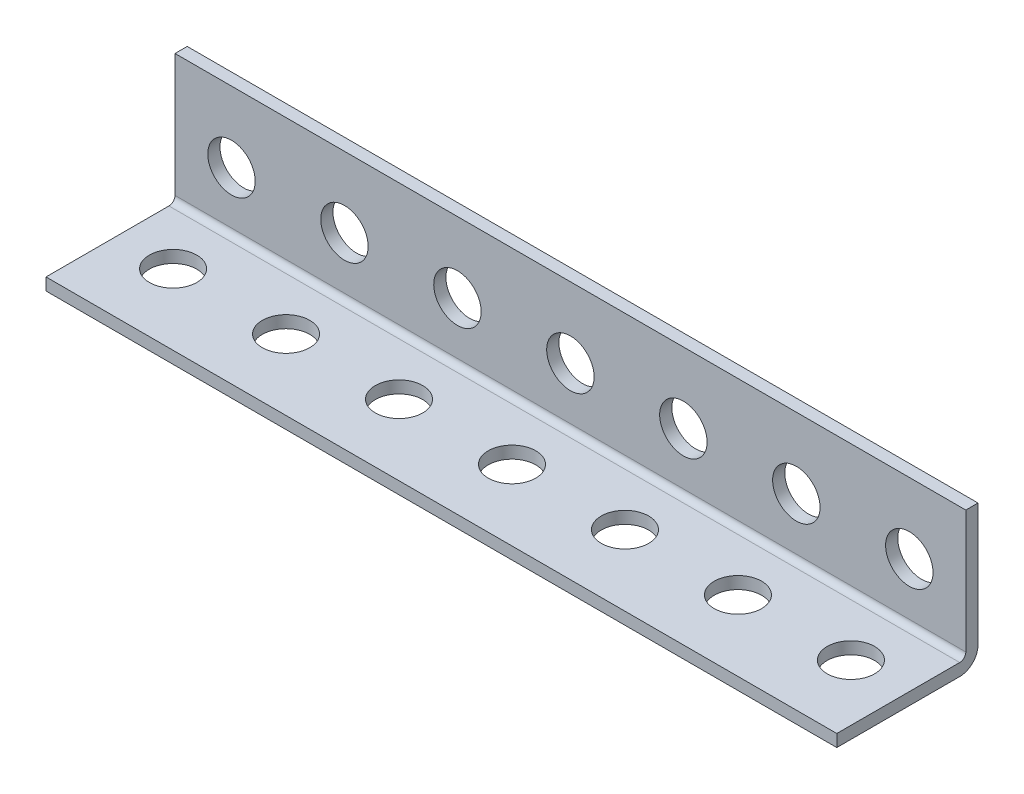
ISO-10303-21;
HEADER;
FILE_DESCRIPTION(('STEP AP214'),'2;1');
FILE_NAME('part.step','',(''),(''),'','','');
FILE_SCHEMA(('AUTOMOTIVE_DESIGN { 1 0 10303 214 1 1 1 1 }'));
ENDSEC;
DATA;
#1=APPLICATION_CONTEXT('core data for automotive mechanical design processes');
#2=APPLICATION_PROTOCOL_DEFINITION('international standard','automotive_design',2000,#1);
#3=PRODUCT_CONTEXT('',#1,'mechanical');
#4=PRODUCT('Part','Part','',(#3));
#5=PRODUCT_RELATED_PRODUCT_CATEGORY('part','',(#4));
#6=PRODUCT_DEFINITION_FORMATION('','',#4);
#7=PRODUCT_DEFINITION_CONTEXT('part definition',#1,'design');
#8=PRODUCT_DEFINITION('design','',#6,#7);
#9=PRODUCT_DEFINITION_SHAPE('','',#8);
#10=(LENGTH_UNIT() NAMED_UNIT(*) SI_UNIT(.MILLI.,.METRE.));
#11=(NAMED_UNIT(*) PLANE_ANGLE_UNIT() SI_UNIT($,.RADIAN.));
#12=(NAMED_UNIT(*) SI_UNIT($,.STERADIAN.) SOLID_ANGLE_UNIT());
#13=UNCERTAINTY_MEASURE_WITH_UNIT(LENGTH_MEASURE(1.E-05),#10,'distance_accuracy_value','');
#14=(GEOMETRIC_REPRESENTATION_CONTEXT(3) GLOBAL_UNCERTAINTY_ASSIGNED_CONTEXT((#13)) GLOBAL_UNIT_ASSIGNED_CONTEXT((#10,
#11,#12)) REPRESENTATION_CONTEXT('',''));
#15=CARTESIAN_POINT('',(0.,0.,0.));
#16=DIRECTION('',(0.,0.,1.));
#17=DIRECTION('',(1.,0.,0.));
#18=AXIS2_PLACEMENT_3D('',#15,#16,#17);
#19=CARTESIAN_POINT('',(609.6,-15.875,15.875));
#20=DIRECTION('',(0.,0.,-1.));
#21=DIRECTION('',(-1.,0.,0.));
#22=AXIS2_PLACEMENT_3D('',#19,#20,#21);
#23=PLANE('',#22);
#24=DIRECTION('',(0.,-1.,0.));
#25=VECTOR('',#24,1.);
#26=CARTESIAN_POINT('',(-431.8,-15.875,15.875));
#27=LINE('',#26,#25);
#28=CARTESIAN_POINT('',(-431.8,-13.1318,15.875));
#29=VERTEX_POINT('',#28);
#30=CARTESIAN_POINT('',(-431.8,-15.875,15.875));
#31=VERTEX_POINT('',#30);
#32=EDGE_CURVE('E284',#29,#31,#27,.T.);
#33=ORIENTED_EDGE('',*,*,#32,.F.);
#34=DIRECTION('',(-1.,0.,0.));
#35=VECTOR('',#34,1.);
#36=CARTESIAN_POINT('',(609.6,-13.1318,15.875));
#37=LINE('',#36,#35);
#38=CARTESIAN_POINT('',(-609.6,-13.1318,15.875));
#39=VERTEX_POINT('',#38);
#40=EDGE_CURVE('E65',#29,#39,#37,.T.);
#41=ORIENTED_EDGE('',*,*,#40,.T.);
#42=DIRECTION('',(0.,-1.,0.));
#43=VECTOR('',#42,1.);
#44=CARTESIAN_POINT('',(-609.6,-15.875,15.875));
#45=LINE('',#44,#43);
#46=CARTESIAN_POINT('',(-609.6,-15.875,15.875));
#47=VERTEX_POINT('',#46);
#48=EDGE_CURVE('E231',#39,#47,#45,.T.);
#49=ORIENTED_EDGE('',*,*,#48,.T.);
#50=DIRECTION('',(-1.,0.,0.));
#51=VECTOR('',#50,1.);
#52=CARTESIAN_POINT('',(609.6,-15.875,15.875));
#53=LINE('',#52,#51);
#54=EDGE_CURVE('E146',#31,#47,#53,.T.);
#55=ORIENTED_EDGE('',*,*,#54,.F.);
#56=EDGE_LOOP('',(#33,#41,#49,#55));
#57=FACE_BOUND('',#56,.T.);
#58=ADVANCED_FACE('F42',(#57),#23,.F.);
#59=CARTESIAN_POINT('',(609.6,-15.875,-11.7602));
#60=DIRECTION('',(0.,1.,0.));
#61=DIRECTION('',(0.,0.,1.));
#62=AXIS2_PLACEMENT_3D('',#59,#60,#61);
#63=PLANE('',#62);
#64=CARTESIAN_POINT('',(-596.9,-15.875,0.));
#65=DIRECTION('',(0.,1.,0.));
#66=DIRECTION('',(0.,0.,1.));
#67=AXIS2_PLACEMENT_3D('',#64,#65,#66);
#68=CIRCLE('',#67,5.33400000000005);
#69=CARTESIAN_POINT('',(-596.9,-15.875,5.33400000000005));
#70=VERTEX_POINT('',#69);
#71=EDGE_CURVE('E243',#70,#70,#68,.T.);
#72=ORIENTED_EDGE('',*,*,#71,.T.);
#73=EDGE_LOOP('',(#72));
#74=FACE_BOUND('',#73,.T.);
#75=CARTESIAN_POINT('',(-571.5,-15.875,0.));
#76=DIRECTION('',(0.,1.,0.));
#77=DIRECTION('',(0.,0.,1.));
#78=AXIS2_PLACEMENT_3D('',#75,#76,#77);
#79=CIRCLE('',#78,5.33400000000005);
#80=CARTESIAN_POINT('',(-571.5,-15.875,5.33400000000005));
#81=VERTEX_POINT('',#80);
#82=EDGE_CURVE('E311',#81,#81,#79,.T.);
#83=ORIENTED_EDGE('',*,*,#82,.T.);
#84=EDGE_LOOP('',(#83));
#85=FACE_BOUND('',#84,.T.);
#86=CARTESIAN_POINT('',(-546.1,-15.875,0.));
#87=DIRECTION('',(0.,1.,0.));
#88=DIRECTION('',(0.,0.,1.));
#89=AXIS2_PLACEMENT_3D('',#86,#87,#88);
#90=CIRCLE('',#89,5.33400000000005);
#91=CARTESIAN_POINT('',(-546.1,-15.875,5.33400000000005));
#92=VERTEX_POINT('',#91);
#93=EDGE_CURVE('E308',#92,#92,#90,.T.);
#94=ORIENTED_EDGE('',*,*,#93,.T.);
#95=EDGE_LOOP('',(#94));
#96=FACE_BOUND('',#95,.T.);
#97=CARTESIAN_POINT('',(-520.7,-15.875,0.));
#98=DIRECTION('',(0.,1.,0.));
#99=DIRECTION('',(0.,0.,1.));
#100=AXIS2_PLACEMENT_3D('',#97,#98,#99);
#101=CIRCLE('',#100,5.33400000000005);
#102=CARTESIAN_POINT('',(-520.7,-15.875,5.33400000000005));
#103=VERTEX_POINT('',#102);
#104=EDGE_CURVE('E304',#103,#103,#101,.T.);
#105=ORIENTED_EDGE('',*,*,#104,.T.);
#106=EDGE_LOOP('',(#105));
#107=FACE_BOUND('',#106,.T.);
#108=CARTESIAN_POINT('',(-495.3,-15.875,0.));
#109=DIRECTION('',(0.,1.,0.));
#110=DIRECTION('',(0.,0.,1.));
#111=AXIS2_PLACEMENT_3D('',#108,#109,#110);
#112=CIRCLE('',#111,5.33400000000005);
#113=CARTESIAN_POINT('',(-495.3,-15.875,5.33400000000005));
#114=VERTEX_POINT('',#113);
#115=EDGE_CURVE('E300',#114,#114,#112,.T.);
#116=ORIENTED_EDGE('',*,*,#115,.T.);
#117=EDGE_LOOP('',(#116));
#118=FACE_BOUND('',#117,.T.);
#119=CARTESIAN_POINT('',(-469.9,-15.875,0.));
#120=DIRECTION('',(0.,1.,0.));
#121=DIRECTION('',(0.,0.,1.));
#122=AXIS2_PLACEMENT_3D('',#119,#120,#121);
#123=CIRCLE('',#122,5.33400000000005);
#124=CARTESIAN_POINT('',(-469.9,-15.875,5.33400000000005));
#125=VERTEX_POINT('',#124);
#126=EDGE_CURVE('E296',#125,#125,#123,.T.);
#127=ORIENTED_EDGE('',*,*,#126,.T.);
#128=EDGE_LOOP('',(#127));
#129=FACE_BOUND('',#128,.T.);
#130=CARTESIAN_POINT('',(-444.5,-15.875,0.));
#131=DIRECTION('',(0.,1.,0.));
#132=DIRECTION('',(0.,0.,1.));
#133=AXIS2_PLACEMENT_3D('',#130,#131,#132);
#134=CIRCLE('',#133,5.33400000000005);
#135=CARTESIAN_POINT('',(-444.5,-15.875,5.33400000000005));
#136=VERTEX_POINT('',#135);
#137=EDGE_CURVE('E209',#136,#136,#134,.T.);
#138=ORIENTED_EDGE('',*,*,#137,.T.);
#139=EDGE_LOOP('',(#138));
#140=FACE_BOUND('',#139,.T.);
#141=DIRECTION('',(0.,0.,-1.));
#142=VECTOR('',#141,1.);
#143=CARTESIAN_POINT('',(-431.8,-15.875,54.125));
#144=LINE('',#143,#142);
#145=CARTESIAN_POINT('',(-431.8,-15.875,-11.7602));
#146=VERTEX_POINT('',#145);
#147=EDGE_CURVE('E127',#31,#146,#144,.T.);
#148=ORIENTED_EDGE('',*,*,#147,.F.);
#149=ORIENTED_EDGE('',*,*,#54,.T.);
#150=DIRECTION('',(0.,0.,-1.));
#151=VECTOR('',#150,1.);
#152=CARTESIAN_POINT('',(-609.6,-15.875,-11.7602));
#153=LINE('',#152,#151);
#154=CARTESIAN_POINT('',(-609.6,-15.875,-11.7602));
#155=VERTEX_POINT('',#154);
#156=EDGE_CURVE('E235',#47,#155,#153,.T.);
#157=ORIENTED_EDGE('',*,*,#156,.T.);
#158=DIRECTION('',(-1.,0.,0.));
#159=VECTOR('',#158,1.);
#160=CARTESIAN_POINT('',(609.6,-15.875,-11.7602));
#161=LINE('',#160,#159);
#162=EDGE_CURVE('E138',#146,#155,#161,.T.);
#163=ORIENTED_EDGE('',*,*,#162,.F.);
#164=EDGE_LOOP('',(#148,#149,#157,#163));
#165=FACE_BOUND('',#164,.T.);
#166=ADVANCED_FACE('F320',(#74,#85,#96,#107,#118,#129,#140,#165),#63,.F.);
#167=CARTESIAN_POINT('',(609.6,-11.7602,-11.7602));
#168=DIRECTION('',(-1.,0.,0.));
#169=DIRECTION('',(0.,0.,1.));
#170=AXIS2_PLACEMENT_3D('',#167,#168,#169);
#171=CYLINDRICAL_SURFACE('',#170,4.11479999999997);
#172=CARTESIAN_POINT('',(-431.8,-11.7602,-11.7602));
#173=DIRECTION('',(1.,0.,0.));
#174=DIRECTION('',(0.,0.,-1.));
#175=AXIS2_PLACEMENT_3D('',#172,#173,#174);
#176=CIRCLE('',#175,4.11479999999997);
#177=CARTESIAN_POINT('',(-431.8,-11.7602,-15.875));
#178=VERTEX_POINT('',#177);
#179=EDGE_CURVE('E113',#146,#178,#176,.T.);
#180=ORIENTED_EDGE('',*,*,#179,.F.);
#181=ORIENTED_EDGE('',*,*,#162,.T.);
#182=CARTESIAN_POINT('',(-609.6,-11.7602,-11.7602));
#183=DIRECTION('',(1.,0.,0.));
#184=DIRECTION('',(0.,0.,1.));
#185=AXIS2_PLACEMENT_3D('',#182,#183,#184);
#186=CIRCLE('',#185,4.11479999999997);
#187=CARTESIAN_POINT('',(-609.6,-11.7602,-15.875));
#188=VERTEX_POINT('',#187);
#189=EDGE_CURVE('E240',#155,#188,#186,.T.);
#190=ORIENTED_EDGE('',*,*,#189,.T.);
#191=DIRECTION('',(-1.,0.,0.));
#192=VECTOR('',#191,1.);
#193=CARTESIAN_POINT('',(609.6,-11.7602,-15.875));
#194=LINE('',#193,#192);
#195=EDGE_CURVE('E134',#178,#188,#194,.T.);
#196=ORIENTED_EDGE('',*,*,#195,.F.);
#197=EDGE_LOOP('',(#180,#181,#190,#196));
#198=FACE_BOUND('',#197,.T.);
#199=ADVANCED_FACE('F349',(#198),#171,.T.);
#200=CARTESIAN_POINT('',(609.6,15.875,-15.875));
#201=DIRECTION('',(0.,0.,1.));
#202=DIRECTION('',(0.,-1.,0.));
#203=AXIS2_PLACEMENT_3D('',#200,#201,#202);
#204=PLANE('',#203);
#205=CARTESIAN_POINT('',(-596.9,-1.46198334882211E-13,-15.875));
#206=DIRECTION('',(0.,0.,1.));
#207=DIRECTION('',(1.,0.,0.));
#208=AXIS2_PLACEMENT_3D('',#205,#206,#207);
#209=CIRCLE('',#208,5.33400000000005);
#210=CARTESIAN_POINT('',(-591.566,-1.46198334882211E-13,-15.875));
#211=VERTEX_POINT('',#210);
#212=EDGE_CURVE('E197',#211,#211,#209,.T.);
#213=ORIENTED_EDGE('',*,*,#212,.T.);
#214=EDGE_LOOP('',(#213));
#215=FACE_BOUND('',#214,.T.);
#216=CARTESIAN_POINT('',(-571.5,-1.43087732012377E-13,-15.875));
#217=DIRECTION('',(0.,0.,1.));
#218=DIRECTION('',(1.,0.,0.));
#219=AXIS2_PLACEMENT_3D('',#216,#217,#218);
#220=CIRCLE('',#219,5.33400000000005);
#221=CARTESIAN_POINT('',(-566.166,-1.43087732012377E-13,-15.875));
#222=VERTEX_POINT('',#221);
#223=EDGE_CURVE('E189',#222,#222,#220,.T.);
#224=ORIENTED_EDGE('',*,*,#223,.T.);
#225=EDGE_LOOP('',(#224));
#226=FACE_BOUND('',#225,.T.);
#227=CARTESIAN_POINT('',(-546.1,-1.39977129142542E-13,-15.875));
#228=DIRECTION('',(0.,0.,1.));
#229=DIRECTION('',(1.,0.,0.));
#230=AXIS2_PLACEMENT_3D('',#227,#228,#229);
#231=CIRCLE('',#230,5.33400000000005);
#232=CARTESIAN_POINT('',(-540.766,-1.39977129142542E-13,-15.875));
#233=VERTEX_POINT('',#232);
#234=EDGE_CURVE('E181',#233,#233,#231,.T.);
#235=ORIENTED_EDGE('',*,*,#234,.T.);
#236=EDGE_LOOP('',(#235));
#237=FACE_BOUND('',#236,.T.);
#238=CARTESIAN_POINT('',(-520.7,-1.36866526272708E-13,-15.875));
#239=DIRECTION('',(0.,0.,1.));
#240=DIRECTION('',(1.,0.,0.));
#241=AXIS2_PLACEMENT_3D('',#238,#239,#240);
#242=CIRCLE('',#241,5.33400000000005);
#243=CARTESIAN_POINT('',(-515.366,-1.36866526272708E-13,-15.875));
#244=VERTEX_POINT('',#243);
#245=EDGE_CURVE('E173',#244,#244,#242,.T.);
#246=ORIENTED_EDGE('',*,*,#245,.T.);
#247=EDGE_LOOP('',(#246));
#248=FACE_BOUND('',#247,.T.);
#249=CARTESIAN_POINT('',(-495.3,-1.33755923402874E-13,-15.875));
#250=DIRECTION('',(0.,0.,1.));
#251=DIRECTION('',(1.,0.,0.));
#252=AXIS2_PLACEMENT_3D('',#249,#250,#251);
#253=CIRCLE('',#252,5.33400000000005);
#254=CARTESIAN_POINT('',(-489.966,-1.33755923402874E-13,-15.875));
#255=VERTEX_POINT('',#254);
#256=EDGE_CURVE('E165',#255,#255,#253,.T.);
#257=ORIENTED_EDGE('',*,*,#256,.T.);
#258=EDGE_LOOP('',(#257));
#259=FACE_BOUND('',#258,.T.);
#260=CARTESIAN_POINT('',(-469.9,-1.3064532053304E-13,-15.875));
#261=DIRECTION('',(0.,0.,1.));
#262=DIRECTION('',(1.,0.,0.));
#263=AXIS2_PLACEMENT_3D('',#260,#261,#262);
#264=CIRCLE('',#263,5.33400000000005);
#265=CARTESIAN_POINT('',(-464.566,-1.3064532053304E-13,-15.875));
#266=VERTEX_POINT('',#265);
#267=EDGE_CURVE('E157',#266,#266,#264,.T.);
#268=ORIENTED_EDGE('',*,*,#267,.T.);
#269=EDGE_LOOP('',(#268));
#270=FACE_BOUND('',#269,.T.);
#271=CARTESIAN_POINT('',(-444.5,-1.27534717663205E-13,-15.875));
#272=DIRECTION('',(0.,0.,1.));
#273=DIRECTION('',(1.,0.,0.));
#274=AXIS2_PLACEMENT_3D('',#271,#272,#273);
#275=CIRCLE('',#274,5.33400000000005);
#276=CARTESIAN_POINT('',(-439.166,-1.27534717663205E-13,-15.875));
#277=VERTEX_POINT('',#276);
#278=EDGE_CURVE('E149',#277,#277,#275,.T.);
#279=ORIENTED_EDGE('',*,*,#278,.T.);
#280=EDGE_LOOP('',(#279));
#281=FACE_BOUND('',#280,.T.);
#282=DIRECTION('',(0.,-1.,0.));
#283=VECTOR('',#282,1.);
#284=CARTESIAN_POINT('',(-431.8,0.,-15.875));
#285=LINE('',#284,#283);
#286=CARTESIAN_POINT('',(-431.8,15.875,-15.875));
#287=VERTEX_POINT('',#286);
#288=EDGE_CURVE('E107',#287,#178,#285,.T.);
#289=ORIENTED_EDGE('',*,*,#288,.T.);
#290=ORIENTED_EDGE('',*,*,#195,.T.);
#291=DIRECTION('',(0.,1.,0.));
#292=VECTOR('',#291,1.);
#293=CARTESIAN_POINT('',(-609.6,15.875,-15.875));
#294=LINE('',#293,#292);
#295=CARTESIAN_POINT('',(-609.6,15.875,-15.875));
#296=VERTEX_POINT('',#295);
#297=EDGE_CURVE('E132',#188,#296,#294,.T.);
#298=ORIENTED_EDGE('',*,*,#297,.T.);
#299=DIRECTION('',(-1.,0.,0.));
#300=VECTOR('',#299,1.);
#301=CARTESIAN_POINT('',(609.6,15.875,-15.875));
#302=LINE('',#301,#300);
#303=EDGE_CURVE('E123',#287,#296,#302,.T.);
#304=ORIENTED_EDGE('',*,*,#303,.F.);
#305=EDGE_LOOP('',(#289,#290,#298,#304));
#306=FACE_BOUND('',#305,.T.);
#307=ADVANCED_FACE('F130',(#215,#226,#237,#248,#259,#270,#281,#306),#204,.F.);
#308=CARTESIAN_POINT('',(609.6,15.875,-13.1318));
#309=DIRECTION('',(0.,-1.,0.));
#310=DIRECTION('',(0.,0.,-1.));
#311=AXIS2_PLACEMENT_3D('',#308,#309,#310);
#312=PLANE('',#311);
#313=DIRECTION('',(0.,0.,-1.));
#314=VECTOR('',#313,1.);
#315=CARTESIAN_POINT('',(-431.8,15.875,54.125));
#316=LINE('',#315,#314);
#317=CARTESIAN_POINT('',(-431.8,15.875,-13.1318));
#318=VERTEX_POINT('',#317);
#319=EDGE_CURVE('E110',#318,#287,#316,.T.);
#320=ORIENTED_EDGE('',*,*,#319,.T.);
#321=ORIENTED_EDGE('',*,*,#303,.T.);
#322=DIRECTION('',(0.,0.,1.));
#323=VECTOR('',#322,1.);
#324=CARTESIAN_POINT('',(-609.6,15.875,-13.1318));
#325=LINE('',#324,#323);
#326=CARTESIAN_POINT('',(-609.6,15.875,-13.1318));
#327=VERTEX_POINT('',#326);
#328=EDGE_CURVE('E251',#296,#327,#325,.T.);
#329=ORIENTED_EDGE('',*,*,#328,.T.);
#330=DIRECTION('',(-1.,0.,0.));
#331=VECTOR('',#330,1.);
#332=CARTESIAN_POINT('',(609.6,15.875,-13.1318));
#333=LINE('',#332,#331);
#334=EDGE_CURVE('E125',#318,#327,#333,.T.);
#335=ORIENTED_EDGE('',*,*,#334,.F.);
#336=EDGE_LOOP('',(#320,#321,#329,#335));
#337=FACE_BOUND('',#336,.T.);
#338=ADVANCED_FACE('F121',(#337),#312,.F.);
#339=CARTESIAN_POINT('',(609.6,-11.7602,-13.1318));
#340=DIRECTION('',(0.,0.,-1.));
#341=DIRECTION('',(0.,1.,0.));
#342=AXIS2_PLACEMENT_3D('',#339,#340,#341);
#343=PLANE('',#342);
#344=CARTESIAN_POINT('',(-596.9,-1.46198334882211E-13,-13.1318));
#345=DIRECTION('',(0.,0.,-1.));
#346=DIRECTION('',(0.,1.,0.));
#347=AXIS2_PLACEMENT_3D('',#344,#345,#346);
#348=CIRCLE('',#347,5.33400000000005);
#349=CARTESIAN_POINT('',(-596.9,5.3339999999999,-13.1318));
#350=VERTEX_POINT('',#349);
#351=EDGE_CURVE('E51',#350,#350,#348,.T.);
#352=ORIENTED_EDGE('',*,*,#351,.T.);
#353=EDGE_LOOP('',(#352));
#354=FACE_BOUND('',#353,.T.);
#355=CARTESIAN_POINT('',(-571.5,-1.43087732012377E-13,-13.1318));
#356=DIRECTION('',(0.,0.,-1.));
#357=DIRECTION('',(0.,1.,0.));
#358=AXIS2_PLACEMENT_3D('',#355,#356,#357);
#359=CIRCLE('',#358,5.33400000000005);
#360=CARTESIAN_POINT('',(-571.5,5.33399999999991,-13.1318));
#361=VERTEX_POINT('',#360);
#362=EDGE_CURVE('E193',#361,#361,#359,.T.);
#363=ORIENTED_EDGE('',*,*,#362,.T.);
#364=EDGE_LOOP('',(#363));
#365=FACE_BOUND('',#364,.T.);
#366=CARTESIAN_POINT('',(-546.1,-1.39977129142542E-13,-13.1318));
#367=DIRECTION('',(0.,0.,-1.));
#368=DIRECTION('',(0.,1.,0.));
#369=AXIS2_PLACEMENT_3D('',#366,#367,#368);
#370=CIRCLE('',#369,5.33400000000005);
#371=CARTESIAN_POINT('',(-546.1,5.33399999999991,-13.1318));
#372=VERTEX_POINT('',#371);
#373=EDGE_CURVE('E185',#372,#372,#370,.T.);
#374=ORIENTED_EDGE('',*,*,#373,.T.);
#375=EDGE_LOOP('',(#374));
#376=FACE_BOUND('',#375,.T.);
#377=CARTESIAN_POINT('',(-520.7,-1.36866526272708E-13,-13.1318));
#378=DIRECTION('',(0.,0.,-1.));
#379=DIRECTION('',(0.,1.,0.));
#380=AXIS2_PLACEMENT_3D('',#377,#378,#379);
#381=CIRCLE('',#380,5.33400000000005);
#382=CARTESIAN_POINT('',(-520.7,5.33399999999991,-13.1318));
#383=VERTEX_POINT('',#382);
#384=EDGE_CURVE('E177',#383,#383,#381,.T.);
#385=ORIENTED_EDGE('',*,*,#384,.T.);
#386=EDGE_LOOP('',(#385));
#387=FACE_BOUND('',#386,.T.);
#388=CARTESIAN_POINT('',(-495.3,-1.33755923402874E-13,-13.1318));
#389=DIRECTION('',(0.,0.,-1.));
#390=DIRECTION('',(0.,1.,0.));
#391=AXIS2_PLACEMENT_3D('',#388,#389,#390);
#392=CIRCLE('',#391,5.33400000000005);
#393=CARTESIAN_POINT('',(-495.3,5.33399999999992,-13.1318));
#394=VERTEX_POINT('',#393);
#395=EDGE_CURVE('E169',#394,#394,#392,.T.);
#396=ORIENTED_EDGE('',*,*,#395,.T.);
#397=EDGE_LOOP('',(#396));
#398=FACE_BOUND('',#397,.T.);
#399=CARTESIAN_POINT('',(-469.9,-1.3064532053304E-13,-13.1318));
#400=DIRECTION('',(0.,0.,-1.));
#401=DIRECTION('',(0.,1.,0.));
#402=AXIS2_PLACEMENT_3D('',#399,#400,#401);
#403=CIRCLE('',#402,5.33400000000005);
#404=CARTESIAN_POINT('',(-469.9,5.33399999999992,-13.1318));
#405=VERTEX_POINT('',#404);
#406=EDGE_CURVE('E161',#405,#405,#403,.T.);
#407=ORIENTED_EDGE('',*,*,#406,.T.);
#408=EDGE_LOOP('',(#407));
#409=FACE_BOUND('',#408,.T.);
#410=CARTESIAN_POINT('',(-444.5,-1.27534717663205E-13,-13.1318));
#411=DIRECTION('',(0.,0.,-1.));
#412=DIRECTION('',(0.,1.,0.));
#413=AXIS2_PLACEMENT_3D('',#410,#411,#412);
#414=CIRCLE('',#413,5.33400000000005);
#415=CARTESIAN_POINT('',(-444.5,5.33399999999992,-13.1318));
#416=VERTEX_POINT('',#415);
#417=EDGE_CURVE('E153',#416,#416,#414,.T.);
#418=ORIENTED_EDGE('',*,*,#417,.T.);
#419=EDGE_LOOP('',(#418));
#420=FACE_BOUND('',#419,.T.);
#421=DIRECTION('',(0.,-1.,0.));
#422=VECTOR('',#421,1.);
#423=CARTESIAN_POINT('',(-431.8,-11.7602,-13.1318));
#424=LINE('',#423,#422);
#425=CARTESIAN_POINT('',(-431.8,-11.7602,-13.1318));
#426=VERTEX_POINT('',#425);
#427=EDGE_CURVE('E282',#318,#426,#424,.T.);
#428=ORIENTED_EDGE('',*,*,#427,.F.);
#429=ORIENTED_EDGE('',*,*,#334,.T.);
#430=DIRECTION('',(0.,-1.,0.));
#431=VECTOR('',#430,1.);
#432=CARTESIAN_POINT('',(-609.6,-11.7602,-13.1318));
#433=LINE('',#432,#431);
#434=CARTESIAN_POINT('',(-609.6,-11.7602,-13.1318));
#435=VERTEX_POINT('',#434);
#436=EDGE_CURVE('E254',#327,#435,#433,.T.);
#437=ORIENTED_EDGE('',*,*,#436,.T.);
#438=DIRECTION('',(-1.,0.,0.));
#439=VECTOR('',#438,1.);
#440=CARTESIAN_POINT('',(609.6,-11.7602,-13.1318));
#441=LINE('',#440,#439);
#442=EDGE_CURVE('E140',#426,#435,#441,.T.);
#443=ORIENTED_EDGE('',*,*,#442,.F.);
#444=EDGE_LOOP('',(#428,#429,#437,#443));
#445=FACE_BOUND('',#444,.T.);
#446=ADVANCED_FACE('F281',(#354,#365,#376,#387,#398,#409,#420,#445),#343,.F.);
#447=CARTESIAN_POINT('',(609.6,-11.7602,-11.7602));
#448=DIRECTION('',(-1.,0.,0.));
#449=DIRECTION('',(0.,0.,1.));
#450=AXIS2_PLACEMENT_3D('',#447,#448,#449);
#451=CYLINDRICAL_SURFACE('',#450,1.37159999999999);
#452=CARTESIAN_POINT('',(-431.8,-11.7602,-11.7602));
#453=DIRECTION('',(1.,0.,0.));
#454=DIRECTION('',(0.,0.,-1.));
#455=AXIS2_PLACEMENT_3D('',#452,#453,#454);
#456=CIRCLE('',#455,1.37159999999999);
#457=CARTESIAN_POINT('',(-431.8,-13.1318,-11.7602));
#458=VERTEX_POINT('',#457);
#459=EDGE_CURVE('E57',#426,#458,#456,.F.);
#460=ORIENTED_EDGE('',*,*,#459,.F.);
#461=ORIENTED_EDGE('',*,*,#442,.T.);
#462=CARTESIAN_POINT('',(-609.6,-11.7602,-11.7602));
#463=DIRECTION('',(-1.,0.,0.));
#464=DIRECTION('',(0.,0.,-1.));
#465=AXIS2_PLACEMENT_3D('',#462,#463,#464);
#466=CIRCLE('',#465,1.37159999999999);
#467=CARTESIAN_POINT('',(-609.6,-13.1318,-11.7602));
#468=VERTEX_POINT('',#467);
#469=EDGE_CURVE('E258',#435,#468,#466,.T.);
#470=ORIENTED_EDGE('',*,*,#469,.T.);
#471=DIRECTION('',(-1.,0.,0.));
#472=VECTOR('',#471,1.);
#473=CARTESIAN_POINT('',(609.6,-13.1318,-11.7602));
#474=LINE('',#473,#472);
#475=EDGE_CURVE('E268',#458,#468,#474,.T.);
#476=ORIENTED_EDGE('',*,*,#475,.F.);
#477=EDGE_LOOP('',(#460,#461,#470,#476));
#478=FACE_BOUND('',#477,.T.);
#479=ADVANCED_FACE('F274',(#478),#451,.F.);
#480=CARTESIAN_POINT('',(609.6,-13.1318,15.875));
#481=DIRECTION('',(0.,-1.,0.));
#482=DIRECTION('',(0.,0.,-1.));
#483=AXIS2_PLACEMENT_3D('',#480,#481,#482);
#484=PLANE('',#483);
#485=CARTESIAN_POINT('',(-596.9,-13.1318,0.));
#486=DIRECTION('',(0.,-1.,0.));
#487=DIRECTION('',(0.,0.,-1.));
#488=AXIS2_PLACEMENT_3D('',#485,#486,#487);
#489=CIRCLE('',#488,5.33400000000005);
#490=CARTESIAN_POINT('',(-596.9,-13.1318,-5.33400000000005));
#491=VERTEX_POINT('',#490);
#492=EDGE_CURVE('E204',#491,#491,#489,.T.);
#493=ORIENTED_EDGE('',*,*,#492,.T.);
#494=EDGE_LOOP('',(#493));
#495=FACE_BOUND('',#494,.T.);
#496=CARTESIAN_POINT('',(-571.5,-13.1318,0.));
#497=DIRECTION('',(0.,-1.,0.));
#498=DIRECTION('',(0.,0.,-1.));
#499=AXIS2_PLACEMENT_3D('',#496,#497,#498);
#500=CIRCLE('',#499,5.33400000000005);
#501=CARTESIAN_POINT('',(-571.5,-13.1318,-5.33400000000005));
#502=VERTEX_POINT('',#501);
#503=EDGE_CURVE('E208',#502,#502,#500,.T.);
#504=ORIENTED_EDGE('',*,*,#503,.T.);
#505=EDGE_LOOP('',(#504));
#506=FACE_BOUND('',#505,.T.);
#507=CARTESIAN_POINT('',(-546.1,-13.1318,0.));
#508=DIRECTION('',(0.,-1.,0.));
#509=DIRECTION('',(0.,0.,-1.));
#510=AXIS2_PLACEMENT_3D('',#507,#508,#509);
#511=CIRCLE('',#510,5.33400000000005);
#512=CARTESIAN_POINT('',(-546.1,-13.1318,-5.33400000000005));
#513=VERTEX_POINT('',#512);
#514=EDGE_CURVE('E213',#513,#513,#511,.T.);
#515=ORIENTED_EDGE('',*,*,#514,.T.);
#516=EDGE_LOOP('',(#515));
#517=FACE_BOUND('',#516,.T.);
#518=CARTESIAN_POINT('',(-520.7,-13.1318,0.));
#519=DIRECTION('',(0.,-1.,0.));
#520=DIRECTION('',(0.,0.,-1.));
#521=AXIS2_PLACEMENT_3D('',#518,#519,#520);
#522=CIRCLE('',#521,5.33400000000005);
#523=CARTESIAN_POINT('',(-520.7,-13.1318,-5.33400000000005));
#524=VERTEX_POINT('',#523);
#525=EDGE_CURVE('E217',#524,#524,#522,.T.);
#526=ORIENTED_EDGE('',*,*,#525,.T.);
#527=EDGE_LOOP('',(#526));
#528=FACE_BOUND('',#527,.T.);
#529=CARTESIAN_POINT('',(-495.3,-13.1318,0.));
#530=DIRECTION('',(0.,-1.,0.));
#531=DIRECTION('',(0.,0.,-1.));
#532=AXIS2_PLACEMENT_3D('',#529,#530,#531);
#533=CIRCLE('',#532,5.33400000000005);
#534=CARTESIAN_POINT('',(-495.3,-13.1318,-5.33400000000005));
#535=VERTEX_POINT('',#534);
#536=EDGE_CURVE('E221',#535,#535,#533,.T.);
#537=ORIENTED_EDGE('',*,*,#536,.T.);
#538=EDGE_LOOP('',(#537));
#539=FACE_BOUND('',#538,.T.);
#540=CARTESIAN_POINT('',(-469.9,-13.1318,0.));
#541=DIRECTION('',(0.,-1.,0.));
#542=DIRECTION('',(0.,0.,-1.));
#543=AXIS2_PLACEMENT_3D('',#540,#541,#542);
#544=CIRCLE('',#543,5.33400000000005);
#545=CARTESIAN_POINT('',(-469.9,-13.1318,-5.33400000000005));
#546=VERTEX_POINT('',#545);
#547=EDGE_CURVE('E225',#546,#546,#544,.T.);
#548=ORIENTED_EDGE('',*,*,#547,.T.);
#549=EDGE_LOOP('',(#548));
#550=FACE_BOUND('',#549,.T.);
#551=CARTESIAN_POINT('',(-444.5,-13.1318,0.));
#552=DIRECTION('',(0.,-1.,0.));
#553=DIRECTION('',(0.,0.,-1.));
#554=AXIS2_PLACEMENT_3D('',#551,#552,#553);
#555=CIRCLE('',#554,5.33400000000005);
#556=CARTESIAN_POINT('',(-444.5,-13.1318,-5.33400000000005));
#557=VERTEX_POINT('',#556);
#558=EDGE_CURVE('E228',#557,#557,#555,.T.);
#559=ORIENTED_EDGE('',*,*,#558,.T.);
#560=EDGE_LOOP('',(#559));
#561=FACE_BOUND('',#560,.T.);
#562=DIRECTION('',(0.,0.,1.));
#563=VECTOR('',#562,1.);
#564=CARTESIAN_POINT('',(-431.8,-13.1318,15.875));
#565=LINE('',#564,#563);
#566=EDGE_CURVE('E11',#458,#29,#565,.T.);
#567=ORIENTED_EDGE('',*,*,#566,.F.);
#568=ORIENTED_EDGE('',*,*,#475,.T.);
#569=DIRECTION('',(0.,0.,1.));
#570=VECTOR('',#569,1.);
#571=CARTESIAN_POINT('',(-609.6,-13.1318,15.875));
#572=LINE('',#571,#570);
#573=EDGE_CURVE('E262',#468,#39,#572,.T.);
#574=ORIENTED_EDGE('',*,*,#573,.T.);
#575=ORIENTED_EDGE('',*,*,#40,.F.);
#576=EDGE_LOOP('',(#567,#568,#574,#575));
#577=FACE_BOUND('',#576,.T.);
#578=ADVANCED_FACE('F329',(#495,#506,#517,#528,#539,#550,#561,#577),#484,.F.);
#579=CARTESIAN_POINT('',(-596.9,-1.46198334882211E-13,-15.875));
#580=DIRECTION('',(0.,0.,1.));
#581=DIRECTION('',(1.,0.,0.));
#582=AXIS2_PLACEMENT_3D('',#579,#580,#581);
#583=CYLINDRICAL_SURFACE('',#582,5.33400000000005);
#584=ORIENTED_EDGE('',*,*,#212,.F.);
#585=EDGE_LOOP('',(#584));
#586=FACE_BOUND('',#585,.T.);
#587=ORIENTED_EDGE('',*,*,#351,.F.);
#588=EDGE_LOOP('',(#587));
#589=FACE_BOUND('',#588,.T.);
#590=ADVANCED_FACE('F44',(#586,#589),#583,.F.);
#591=CARTESIAN_POINT('',(-571.5,-1.43087732012377E-13,-15.875));
#592=DIRECTION('',(0.,0.,1.));
#593=DIRECTION('',(1.,0.,0.));
#594=AXIS2_PLACEMENT_3D('',#591,#592,#593);
#595=CYLINDRICAL_SURFACE('',#594,5.33400000000005);
#596=ORIENTED_EDGE('',*,*,#223,.F.);
#597=EDGE_LOOP('',(#596));
#598=FACE_BOUND('',#597,.T.);
#599=ORIENTED_EDGE('',*,*,#362,.F.);
#600=EDGE_LOOP('',(#599));
#601=FACE_BOUND('',#600,.T.);
#602=ADVANCED_FACE('F382',(#598,#601),#595,.F.);
#603=CARTESIAN_POINT('',(-546.1,-1.39977129142542E-13,-15.875));
#604=DIRECTION('',(0.,0.,1.));
#605=DIRECTION('',(1.,0.,0.));
#606=AXIS2_PLACEMENT_3D('',#603,#604,#605);
#607=CYLINDRICAL_SURFACE('',#606,5.33400000000005);
#608=ORIENTED_EDGE('',*,*,#234,.F.);
#609=EDGE_LOOP('',(#608));
#610=FACE_BOUND('',#609,.T.);
#611=ORIENTED_EDGE('',*,*,#373,.F.);
#612=EDGE_LOOP('',(#611));
#613=FACE_BOUND('',#612,.T.);
#614=ADVANCED_FACE('F379',(#610,#613),#607,.F.);
#615=CARTESIAN_POINT('',(-520.7,-1.36866526272708E-13,-15.875));
#616=DIRECTION('',(0.,0.,1.));
#617=DIRECTION('',(1.,0.,0.));
#618=AXIS2_PLACEMENT_3D('',#615,#616,#617);
#619=CYLINDRICAL_SURFACE('',#618,5.33400000000005);
#620=ORIENTED_EDGE('',*,*,#245,.F.);
#621=EDGE_LOOP('',(#620));
#622=FACE_BOUND('',#621,.T.);
#623=ORIENTED_EDGE('',*,*,#384,.F.);
#624=EDGE_LOOP('',(#623));
#625=FACE_BOUND('',#624,.T.);
#626=ADVANCED_FACE('F375',(#622,#625),#619,.F.);
#627=CARTESIAN_POINT('',(-495.3,-1.33755923402874E-13,-15.875));
#628=DIRECTION('',(0.,0.,1.));
#629=DIRECTION('',(1.,0.,0.));
#630=AXIS2_PLACEMENT_3D('',#627,#628,#629);
#631=CYLINDRICAL_SURFACE('',#630,5.33400000000005);
#632=ORIENTED_EDGE('',*,*,#256,.F.);
#633=EDGE_LOOP('',(#632));
#634=FACE_BOUND('',#633,.T.);
#635=ORIENTED_EDGE('',*,*,#395,.F.);
#636=EDGE_LOOP('',(#635));
#637=FACE_BOUND('',#636,.T.);
#638=ADVANCED_FACE('F371',(#634,#637),#631,.F.);
#639=CARTESIAN_POINT('',(-469.9,-1.3064532053304E-13,-15.875));
#640=DIRECTION('',(0.,0.,1.));
#641=DIRECTION('',(1.,0.,0.));
#642=AXIS2_PLACEMENT_3D('',#639,#640,#641);
#643=CYLINDRICAL_SURFACE('',#642,5.33400000000005);
#644=ORIENTED_EDGE('',*,*,#267,.F.);
#645=EDGE_LOOP('',(#644));
#646=FACE_BOUND('',#645,.T.);
#647=ORIENTED_EDGE('',*,*,#406,.F.);
#648=EDGE_LOOP('',(#647));
#649=FACE_BOUND('',#648,.T.);
#650=ADVANCED_FACE('F367',(#646,#649),#643,.F.);
#651=CARTESIAN_POINT('',(-444.5,-1.27534717663205E-13,-15.875));
#652=DIRECTION('',(0.,0.,1.));
#653=DIRECTION('',(1.,0.,0.));
#654=AXIS2_PLACEMENT_3D('',#651,#652,#653);
#655=CYLINDRICAL_SURFACE('',#654,5.33400000000005);
#656=ORIENTED_EDGE('',*,*,#278,.F.);
#657=EDGE_LOOP('',(#656));
#658=FACE_BOUND('',#657,.T.);
#659=ORIENTED_EDGE('',*,*,#417,.F.);
#660=EDGE_LOOP('',(#659));
#661=FACE_BOUND('',#660,.T.);
#662=ADVANCED_FACE('F364',(#658,#661),#655,.F.);
#663=CARTESIAN_POINT('',(-609.6,-11.7602,-11.7602));
#664=DIRECTION('',(1.,0.,0.));
#665=DIRECTION('',(0.,0.,-1.));
#666=AXIS2_PLACEMENT_3D('',#663,#664,#665);
#667=PLANE('',#666);
#668=ORIENTED_EDGE('',*,*,#48,.F.);
#669=ORIENTED_EDGE('',*,*,#573,.F.);
#670=ORIENTED_EDGE('',*,*,#469,.F.);
#671=ORIENTED_EDGE('',*,*,#436,.F.);
#672=ORIENTED_EDGE('',*,*,#328,.F.);
#673=ORIENTED_EDGE('',*,*,#297,.F.);
#674=ORIENTED_EDGE('',*,*,#189,.F.);
#675=ORIENTED_EDGE('',*,*,#156,.F.);
#676=EDGE_LOOP('',(#668,#669,#670,#671,#672,#673,#674,#675));
#677=FACE_BOUND('',#676,.T.);
#678=ADVANCED_FACE('F280',(#677),#667,.F.);
#679=CARTESIAN_POINT('',(-596.9,-15.875,0.));
#680=DIRECTION('',(0.,1.,0.));
#681=DIRECTION('',(0.,0.,1.));
#682=AXIS2_PLACEMENT_3D('',#679,#680,#681);
#683=CYLINDRICAL_SURFACE('',#682,5.33400000000005);
#684=ORIENTED_EDGE('',*,*,#71,.F.);
#685=EDGE_LOOP('',(#684));
#686=FACE_BOUND('',#685,.T.);
#687=ORIENTED_EDGE('',*,*,#492,.F.);
#688=EDGE_LOOP('',(#687));
#689=FACE_BOUND('',#688,.T.);
#690=ADVANCED_FACE('F322',(#686,#689),#683,.F.);
#691=CARTESIAN_POINT('',(-571.5,-15.875,0.));
#692=DIRECTION('',(0.,1.,0.));
#693=DIRECTION('',(0.,0.,1.));
#694=AXIS2_PLACEMENT_3D('',#691,#692,#693);
#695=CYLINDRICAL_SURFACE('',#694,5.33400000000005);
#696=ORIENTED_EDGE('',*,*,#82,.F.);
#697=EDGE_LOOP('',(#696));
#698=FACE_BOUND('',#697,.T.);
#699=ORIENTED_EDGE('',*,*,#503,.F.);
#700=EDGE_LOOP('',(#699));
#701=FACE_BOUND('',#700,.T.);
#702=ADVANCED_FACE('F325',(#698,#701),#695,.F.);
#703=CARTESIAN_POINT('',(-546.1,-15.875,0.));
#704=DIRECTION('',(0.,1.,0.));
#705=DIRECTION('',(0.,0.,1.));
#706=AXIS2_PLACEMENT_3D('',#703,#704,#705);
#707=CYLINDRICAL_SURFACE('',#706,5.33400000000005);
#708=ORIENTED_EDGE('',*,*,#93,.F.);
#709=EDGE_LOOP('',(#708));
#710=FACE_BOUND('',#709,.T.);
#711=ORIENTED_EDGE('',*,*,#514,.F.);
#712=EDGE_LOOP('',(#711));
#713=FACE_BOUND('',#712,.T.);
#714=ADVANCED_FACE('F423',(#710,#713),#707,.F.);
#715=CARTESIAN_POINT('',(-520.7,-15.875,0.));
#716=DIRECTION('',(0.,1.,0.));
#717=DIRECTION('',(0.,0.,1.));
#718=AXIS2_PLACEMENT_3D('',#715,#716,#717);
#719=CYLINDRICAL_SURFACE('',#718,5.33400000000005);
#720=ORIENTED_EDGE('',*,*,#104,.F.);
#721=EDGE_LOOP('',(#720));
#722=FACE_BOUND('',#721,.T.);
#723=ORIENTED_EDGE('',*,*,#525,.F.);
#724=EDGE_LOOP('',(#723));
#725=FACE_BOUND('',#724,.T.);
#726=ADVANCED_FACE('F427',(#722,#725),#719,.F.);
#727=CARTESIAN_POINT('',(-495.3,-15.875,0.));
#728=DIRECTION('',(0.,1.,0.));
#729=DIRECTION('',(0.,0.,1.));
#730=AXIS2_PLACEMENT_3D('',#727,#728,#729);
#731=CYLINDRICAL_SURFACE('',#730,5.33400000000005);
#732=ORIENTED_EDGE('',*,*,#115,.F.);
#733=EDGE_LOOP('',(#732));
#734=FACE_BOUND('',#733,.T.);
#735=ORIENTED_EDGE('',*,*,#536,.F.);
#736=EDGE_LOOP('',(#735));
#737=FACE_BOUND('',#736,.T.);
#738=ADVANCED_FACE('F431',(#734,#737),#731,.F.);
#739=CARTESIAN_POINT('',(-469.9,-15.875,0.));
#740=DIRECTION('',(0.,1.,0.));
#741=DIRECTION('',(0.,0.,1.));
#742=AXIS2_PLACEMENT_3D('',#739,#740,#741);
#743=CYLINDRICAL_SURFACE('',#742,5.33400000000005);
#744=ORIENTED_EDGE('',*,*,#126,.F.);
#745=EDGE_LOOP('',(#744));
#746=FACE_BOUND('',#745,.T.);
#747=ORIENTED_EDGE('',*,*,#547,.F.);
#748=EDGE_LOOP('',(#747));
#749=FACE_BOUND('',#748,.T.);
#750=ADVANCED_FACE('F435',(#746,#749),#743,.F.);
#751=CARTESIAN_POINT('',(-444.5,-15.875,0.));
#752=DIRECTION('',(0.,1.,0.));
#753=DIRECTION('',(0.,0.,1.));
#754=AXIS2_PLACEMENT_3D('',#751,#752,#753);
#755=CYLINDRICAL_SURFACE('',#754,5.33400000000005);
#756=ORIENTED_EDGE('',*,*,#137,.F.);
#757=EDGE_LOOP('',(#756));
#758=FACE_BOUND('',#757,.T.);
#759=ORIENTED_EDGE('',*,*,#558,.F.);
#760=EDGE_LOOP('',(#759));
#761=FACE_BOUND('',#760,.T.);
#762=ADVANCED_FACE('F439',(#758,#761),#755,.F.);
#763=CARTESIAN_POINT('',(-431.8,0.,54.125));
#764=DIRECTION('',(1.,0.,0.));
#765=DIRECTION('',(0.,0.,-1.));
#766=AXIS2_PLACEMENT_3D('',#763,#764,#765);
#767=PLANE('',#766);
#768=ORIENTED_EDGE('',*,*,#179,.T.);
#769=ORIENTED_EDGE('',*,*,#288,.F.);
#770=ORIENTED_EDGE('',*,*,#319,.F.);
#771=ORIENTED_EDGE('',*,*,#427,.T.);
#772=ORIENTED_EDGE('',*,*,#459,.T.);
#773=ORIENTED_EDGE('',*,*,#566,.T.);
#774=ORIENTED_EDGE('',*,*,#32,.T.);
#775=ORIENTED_EDGE('',*,*,#147,.T.);
#776=EDGE_LOOP('',(#768,#769,#770,#771,#772,#773,#774,#775));
#777=FACE_BOUND('',#776,.T.);
#778=ADVANCED_FACE('F109',(#777),#767,.T.);
#779=CLOSED_SHELL('',(#58,#166,#199,#307,#338,#446,#479,#578,#590,#602,#614,#626,#638,#650,#662,
#678,#690,#702,#714,#726,#738,#750,#762,#778));
#780=MANIFOLD_SOLID_BREP('B2',#779);
#781=ADVANCED_BREP_SHAPE_REPRESENTATION('',(#18,#780),#14);
#782=SHAPE_DEFINITION_REPRESENTATION(#9,#781);
ENDSEC;
END-ISO-10303-21;
